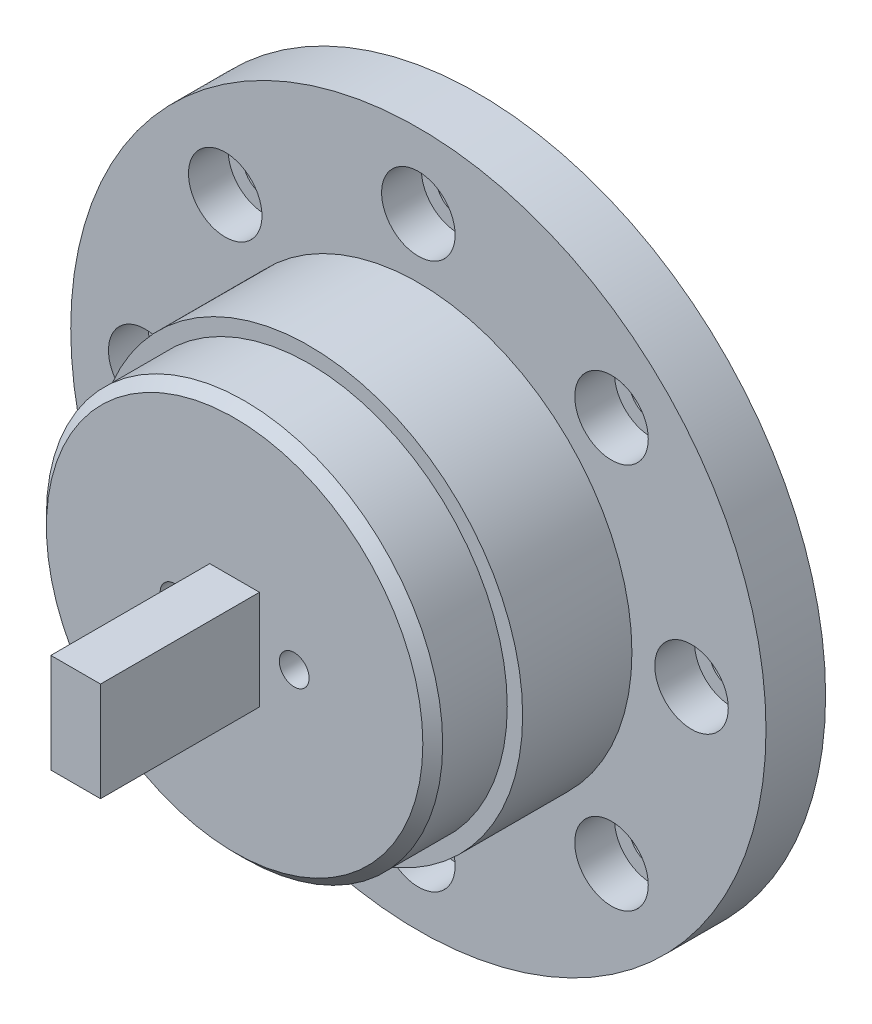
ISO-10303-21;
HEADER;
FILE_DESCRIPTION(('STEP AP214'),'2;1');
FILE_NAME('part.step','',(''),(''),'','','');
FILE_SCHEMA(('AUTOMOTIVE_DESIGN { 1 0 10303 214 1 1 1 1 }'));
ENDSEC;
DATA;
#1=APPLICATION_CONTEXT('core data for automotive mechanical design processes');
#2=APPLICATION_PROTOCOL_DEFINITION('international standard','automotive_design',2000,#1);
#3=PRODUCT_CONTEXT('',#1,'mechanical');
#4=PRODUCT('Part','Part','',(#3));
#5=PRODUCT_RELATED_PRODUCT_CATEGORY('part','',(#4));
#6=PRODUCT_DEFINITION_FORMATION('','',#4);
#7=PRODUCT_DEFINITION_CONTEXT('part definition',#1,'design');
#8=PRODUCT_DEFINITION('design','',#6,#7);
#9=PRODUCT_DEFINITION_SHAPE('','',#8);
#10=(LENGTH_UNIT() NAMED_UNIT(*) SI_UNIT(.MILLI.,.METRE.));
#11=(NAMED_UNIT(*) PLANE_ANGLE_UNIT() SI_UNIT($,.RADIAN.));
#12=(NAMED_UNIT(*) SI_UNIT($,.STERADIAN.) SOLID_ANGLE_UNIT());
#13=UNCERTAINTY_MEASURE_WITH_UNIT(LENGTH_MEASURE(1.E-05),#10,'distance_accuracy_value','');
#14=(GEOMETRIC_REPRESENTATION_CONTEXT(3) GLOBAL_UNCERTAINTY_ASSIGNED_CONTEXT((#13)) GLOBAL_UNIT_ASSIGNED_CONTEXT((#10,
#11,#12)) REPRESENTATION_CONTEXT('',''));
#15=CARTESIAN_POINT('',(0.,0.,0.));
#16=DIRECTION('',(0.,0.,1.));
#17=DIRECTION('',(1.,0.,0.));
#18=AXIS2_PLACEMENT_3D('',#15,#16,#17);
#19=CARTESIAN_POINT('',(0.,0.,2.));
#20=DIRECTION('',(0.,0.,1.));
#21=DIRECTION('',(1.,0.,0.));
#22=AXIS2_PLACEMENT_3D('',#19,#20,#21);
#23=PLANE('',#22);
#24=CARTESIAN_POINT('',(-27.5,0.,2.));
#25=DIRECTION('',(0.,0.,1.));
#26=DIRECTION('',(1.,0.,0.));
#27=AXIS2_PLACEMENT_3D('',#24,#25,#26);
#28=CIRCLE('',#27,2.2);
#29=CARTESIAN_POINT('',(-25.3,0.,2.));
#30=VERTEX_POINT('',#29);
#31=EDGE_CURVE('E221',#30,#30,#28,.T.);
#32=ORIENTED_EDGE('',*,*,#31,.F.);
#33=EDGE_LOOP('',(#32));
#34=FACE_BOUND('',#33,.T.);
#35=CARTESIAN_POINT('',(-27.5,0.,2.));
#36=DIRECTION('',(0.,0.,1.));
#37=DIRECTION('',(1.,0.,0.));
#38=AXIS2_PLACEMENT_3D('',#35,#36,#37);
#39=CIRCLE('',#38,3.7);
#40=CARTESIAN_POINT('',(-23.8,0.,2.));
#41=VERTEX_POINT('',#40);
#42=EDGE_CURVE('E146',#41,#41,#39,.T.);
#43=ORIENTED_EDGE('',*,*,#42,.T.);
#44=EDGE_LOOP('',(#43));
#45=FACE_BOUND('',#44,.T.);
#46=ADVANCED_FACE('F46',(#34,#45),#23,.T.);
#47=CARTESIAN_POINT('',(0.,-27.5,2.));
#48=DIRECTION('',(0.,0.,1.));
#49=DIRECTION('',(1.,0.,0.));
#50=AXIS2_PLACEMENT_3D('',#47,#48,#49);
#51=CIRCLE('',#50,2.2);
#52=CARTESIAN_POINT('',(2.2,-27.5,2.));
#53=VERTEX_POINT('',#52);
#54=EDGE_CURVE('E237',#53,#53,#51,.T.);
#55=ORIENTED_EDGE('',*,*,#54,.F.);
#56=EDGE_LOOP('',(#55));
#57=FACE_BOUND('',#56,.T.);
#58=CARTESIAN_POINT('',(0.,-27.5,2.));
#59=DIRECTION('',(0.,0.,1.));
#60=DIRECTION('',(1.,0.,0.));
#61=AXIS2_PLACEMENT_3D('',#58,#59,#60);
#62=CIRCLE('',#61,3.7);
#63=CARTESIAN_POINT('',(3.7,-27.5,2.));
#64=VERTEX_POINT('',#63);
#65=EDGE_CURVE('E187',#64,#64,#62,.T.);
#66=ORIENTED_EDGE('',*,*,#65,.T.);
#67=EDGE_LOOP('',(#66));
#68=FACE_BOUND('',#67,.T.);
#69=ADVANCED_FACE('F300',(#57,#68),#23,.T.);
#70=CARTESIAN_POINT('',(27.5,0.,2.));
#71=DIRECTION('',(0.,0.,1.));
#72=DIRECTION('',(1.,0.,0.));
#73=AXIS2_PLACEMENT_3D('',#70,#71,#72);
#74=CIRCLE('',#73,2.2);
#75=CARTESIAN_POINT('',(29.7,0.,2.));
#76=VERTEX_POINT('',#75);
#77=EDGE_CURVE('E253',#76,#76,#74,.T.);
#78=ORIENTED_EDGE('',*,*,#77,.F.);
#79=EDGE_LOOP('',(#78));
#80=FACE_BOUND('',#79,.T.);
#81=CARTESIAN_POINT('',(27.5,0.,2.));
#82=DIRECTION('',(0.,0.,1.));
#83=DIRECTION('',(1.,0.,0.));
#84=AXIS2_PLACEMENT_3D('',#81,#82,#83);
#85=CIRCLE('',#84,3.7);
#86=CARTESIAN_POINT('',(31.2,0.,2.));
#87=VERTEX_POINT('',#86);
#88=EDGE_CURVE('E191',#87,#87,#85,.T.);
#89=ORIENTED_EDGE('',*,*,#88,.T.);
#90=EDGE_LOOP('',(#89));
#91=FACE_BOUND('',#90,.T.);
#92=ADVANCED_FACE('F307',(#80,#91),#23,.T.);
#93=CARTESIAN_POINT('',(0.,27.5,2.));
#94=DIRECTION('',(0.,0.,1.));
#95=DIRECTION('',(1.,0.,0.));
#96=AXIS2_PLACEMENT_3D('',#93,#94,#95);
#97=CIRCLE('',#96,2.2);
#98=CARTESIAN_POINT('',(2.2,27.5,2.));
#99=VERTEX_POINT('',#98);
#100=EDGE_CURVE('E267',#99,#99,#97,.T.);
#101=ORIENTED_EDGE('',*,*,#100,.F.);
#102=EDGE_LOOP('',(#101));
#103=FACE_BOUND('',#102,.T.);
#104=CARTESIAN_POINT('',(0.,27.5,2.));
#105=DIRECTION('',(0.,0.,1.));
#106=DIRECTION('',(1.,0.,0.));
#107=AXIS2_PLACEMENT_3D('',#104,#105,#106);
#108=CIRCLE('',#107,3.7);
#109=CARTESIAN_POINT('',(3.7,27.5,2.));
#110=VERTEX_POINT('',#109);
#111=EDGE_CURVE('E194',#110,#110,#108,.T.);
#112=ORIENTED_EDGE('',*,*,#111,.T.);
#113=EDGE_LOOP('',(#112));
#114=FACE_BOUND('',#113,.T.);
#115=ADVANCED_FACE('F427',(#103,#114),#23,.T.);
#116=CARTESIAN_POINT('',(19.4454364826301,19.4454364826301,2.));
#117=DIRECTION('',(0.,0.,1.));
#118=DIRECTION('',(1.,0.,0.));
#119=AXIS2_PLACEMENT_3D('',#116,#117,#118);
#120=CIRCLE('',#119,2.20000000000001);
#121=CARTESIAN_POINT('',(21.6454364826301,19.4454364826301,2.));
#122=VERTEX_POINT('',#121);
#123=EDGE_CURVE('E259',#122,#122,#120,.T.);
#124=ORIENTED_EDGE('',*,*,#123,.F.);
#125=EDGE_LOOP('',(#124));
#126=FACE_BOUND('',#125,.T.);
#127=CARTESIAN_POINT('',(19.4454364826301,19.4454364826301,2.));
#128=DIRECTION('',(0.,0.,1.));
#129=DIRECTION('',(1.,0.,0.));
#130=AXIS2_PLACEMENT_3D('',#127,#128,#129);
#131=CIRCLE('',#130,3.70000000000001);
#132=CARTESIAN_POINT('',(23.1454364826301,19.4454364826301,2.));
#133=VERTEX_POINT('',#132);
#134=EDGE_CURVE('E198',#133,#133,#131,.T.);
#135=ORIENTED_EDGE('',*,*,#134,.T.);
#136=EDGE_LOOP('',(#135));
#137=FACE_BOUND('',#136,.T.);
#138=ADVANCED_FACE('F430',(#126,#137),#23,.T.);
#139=CARTESIAN_POINT('',(19.4454364826301,-19.4454364826301,2.));
#140=DIRECTION('',(0.,0.,1.));
#141=DIRECTION('',(1.,0.,0.));
#142=AXIS2_PLACEMENT_3D('',#139,#140,#141);
#143=CIRCLE('',#142,2.20000000000001);
#144=CARTESIAN_POINT('',(21.6454364826301,-19.4454364826301,2.));
#145=VERTEX_POINT('',#144);
#146=EDGE_CURVE('E245',#145,#145,#143,.T.);
#147=ORIENTED_EDGE('',*,*,#146,.F.);
#148=EDGE_LOOP('',(#147));
#149=FACE_BOUND('',#148,.T.);
#150=CARTESIAN_POINT('',(19.4454364826301,-19.4454364826301,2.));
#151=DIRECTION('',(0.,0.,1.));
#152=DIRECTION('',(1.,0.,0.));
#153=AXIS2_PLACEMENT_3D('',#150,#151,#152);
#154=CIRCLE('',#153,3.70000000000001);
#155=CARTESIAN_POINT('',(23.1454364826301,-19.4454364826301,2.));
#156=VERTEX_POINT('',#155);
#157=EDGE_CURVE('E202',#156,#156,#154,.T.);
#158=ORIENTED_EDGE('',*,*,#157,.T.);
#159=EDGE_LOOP('',(#158));
#160=FACE_BOUND('',#159,.T.);
#161=ADVANCED_FACE('F323',(#149,#160),#23,.T.);
#162=CARTESIAN_POINT('',(-19.4454364826301,-19.4454364826301,2.));
#163=DIRECTION('',(0.,0.,1.));
#164=DIRECTION('',(1.,0.,0.));
#165=AXIS2_PLACEMENT_3D('',#162,#163,#164);
#166=CIRCLE('',#165,2.2);
#167=CARTESIAN_POINT('',(-17.2454364826301,-19.4454364826301,2.));
#168=VERTEX_POINT('',#167);
#169=EDGE_CURVE('E229',#168,#168,#166,.T.);
#170=ORIENTED_EDGE('',*,*,#169,.F.);
#171=EDGE_LOOP('',(#170));
#172=FACE_BOUND('',#171,.T.);
#173=CARTESIAN_POINT('',(-19.4454364826301,-19.4454364826301,2.));
#174=DIRECTION('',(0.,0.,1.));
#175=DIRECTION('',(1.,0.,0.));
#176=AXIS2_PLACEMENT_3D('',#173,#174,#175);
#177=CIRCLE('',#176,3.7);
#178=CARTESIAN_POINT('',(-15.7454364826301,-19.4454364826301,2.));
#179=VERTEX_POINT('',#178);
#180=EDGE_CURVE('E206',#179,#179,#177,.T.);
#181=ORIENTED_EDGE('',*,*,#180,.T.);
#182=EDGE_LOOP('',(#181));
#183=FACE_BOUND('',#182,.T.);
#184=ADVANCED_FACE('F315',(#172,#183),#23,.T.);
#185=CARTESIAN_POINT('',(-19.4454364826301,19.4454364826301,2.));
#186=DIRECTION('',(0.,0.,1.));
#187=DIRECTION('',(1.,0.,0.));
#188=AXIS2_PLACEMENT_3D('',#185,#186,#187);
#189=CIRCLE('',#188,2.2);
#190=CARTESIAN_POINT('',(-17.2454364826301,19.4454364826301,2.));
#191=VERTEX_POINT('',#190);
#192=EDGE_CURVE('E213',#191,#191,#189,.T.);
#193=ORIENTED_EDGE('',*,*,#192,.F.);
#194=EDGE_LOOP('',(#193));
#195=FACE_BOUND('',#194,.T.);
#196=CARTESIAN_POINT('',(-19.4454364826301,19.4454364826301,2.));
#197=DIRECTION('',(0.,0.,1.));
#198=DIRECTION('',(1.,0.,0.));
#199=AXIS2_PLACEMENT_3D('',#196,#197,#198);
#200=CIRCLE('',#199,3.7);
#201=CARTESIAN_POINT('',(-15.7454364826301,19.4454364826301,2.));
#202=VERTEX_POINT('',#201);
#203=EDGE_CURVE('E152',#202,#202,#200,.T.);
#204=ORIENTED_EDGE('',*,*,#203,.T.);
#205=EDGE_LOOP('',(#204));
#206=FACE_BOUND('',#205,.T.);
#207=ADVANCED_FACE('F303',(#195,#206),#23,.T.);
#208=CARTESIAN_POINT('',(0.,0.,0.));
#209=DIRECTION('',(0.,0.,1.));
#210=DIRECTION('',(1.,0.,0.));
#211=AXIS2_PLACEMENT_3D('',#208,#209,#210);
#212=PLANE('',#211);
#213=CARTESIAN_POINT('',(-6.,0.,0.));
#214=DIRECTION('',(0.,0.,1.));
#215=DIRECTION('',(1.,0.,0.));
#216=AXIS2_PLACEMENT_3D('',#213,#214,#215);
#217=CIRCLE('',#216,1.5);
#218=CARTESIAN_POINT('',(-4.5,0.,0.));
#219=VERTEX_POINT('',#218);
#220=EDGE_CURVE('E824',#219,#219,#217,.T.);
#221=ORIENTED_EDGE('',*,*,#220,.T.);
#222=EDGE_LOOP('',(#221));
#223=FACE_BOUND('',#222,.T.);
#224=CARTESIAN_POINT('',(6.,0.,0.));
#225=DIRECTION('',(0.,0.,1.));
#226=DIRECTION('',(1.,0.,0.));
#227=AXIS2_PLACEMENT_3D('',#224,#225,#226);
#228=CIRCLE('',#227,1.5);
#229=CARTESIAN_POINT('',(7.5,0.,0.));
#230=VERTEX_POINT('',#229);
#231=EDGE_CURVE('E839',#230,#230,#228,.T.);
#232=ORIENTED_EDGE('',*,*,#231,.T.);
#233=EDGE_LOOP('',(#232));
#234=FACE_BOUND('',#233,.T.);
#235=CARTESIAN_POINT('',(0.,0.,0.));
#236=DIRECTION('',(0.,0.,1.));
#237=DIRECTION('',(1.,0.,0.));
#238=AXIS2_PLACEMENT_3D('',#235,#236,#237);
#239=CIRCLE('',#238,35.);
#240=CARTESIAN_POINT('',(35.,0.,0.));
#241=VERTEX_POINT('',#240);
#242=EDGE_CURVE('E271',#241,#241,#239,.T.);
#243=ORIENTED_EDGE('',*,*,#242,.F.);
#244=EDGE_LOOP('',(#243));
#245=FACE_BOUND('',#244,.T.);
#246=CARTESIAN_POINT('',(0.,27.5,0.));
#247=DIRECTION('',(0.,0.,1.));
#248=DIRECTION('',(1.,0.,0.));
#249=AXIS2_PLACEMENT_3D('',#246,#247,#248);
#250=CIRCLE('',#249,2.2);
#251=CARTESIAN_POINT('',(2.2,27.5,0.));
#252=VERTEX_POINT('',#251);
#253=EDGE_CURVE('E263',#252,#252,#250,.T.);
#254=ORIENTED_EDGE('',*,*,#253,.T.);
#255=EDGE_LOOP('',(#254));
#256=FACE_BOUND('',#255,.T.);
#257=CARTESIAN_POINT('',(19.4454364826301,19.4454364826301,0.));
#258=DIRECTION('',(0.,0.,1.));
#259=DIRECTION('',(1.,0.,0.));
#260=AXIS2_PLACEMENT_3D('',#257,#258,#259);
#261=CIRCLE('',#260,2.20000000000001);
#262=CARTESIAN_POINT('',(21.6454364826301,19.4454364826301,0.));
#263=VERTEX_POINT('',#262);
#264=EDGE_CURVE('E256',#263,#263,#261,.T.);
#265=ORIENTED_EDGE('',*,*,#264,.T.);
#266=EDGE_LOOP('',(#265));
#267=FACE_BOUND('',#266,.T.);
#268=CARTESIAN_POINT('',(27.5,0.,0.));
#269=DIRECTION('',(0.,0.,1.));
#270=DIRECTION('',(1.,0.,0.));
#271=AXIS2_PLACEMENT_3D('',#268,#269,#270);
#272=CIRCLE('',#271,2.2);
#273=CARTESIAN_POINT('',(29.7,0.,0.));
#274=VERTEX_POINT('',#273);
#275=EDGE_CURVE('E249',#274,#274,#272,.T.);
#276=ORIENTED_EDGE('',*,*,#275,.T.);
#277=EDGE_LOOP('',(#276));
#278=FACE_BOUND('',#277,.T.);
#279=CARTESIAN_POINT('',(19.4454364826301,-19.4454364826301,0.));
#280=DIRECTION('',(0.,0.,1.));
#281=DIRECTION('',(1.,0.,0.));
#282=AXIS2_PLACEMENT_3D('',#279,#280,#281);
#283=CIRCLE('',#282,2.20000000000001);
#284=CARTESIAN_POINT('',(21.6454364826301,-19.4454364826301,0.));
#285=VERTEX_POINT('',#284);
#286=EDGE_CURVE('E241',#285,#285,#283,.T.);
#287=ORIENTED_EDGE('',*,*,#286,.T.);
#288=EDGE_LOOP('',(#287));
#289=FACE_BOUND('',#288,.T.);
#290=CARTESIAN_POINT('',(0.,-27.5,0.));
#291=DIRECTION('',(0.,0.,1.));
#292=DIRECTION('',(1.,0.,0.));
#293=AXIS2_PLACEMENT_3D('',#290,#291,#292);
#294=CIRCLE('',#293,2.2);
#295=CARTESIAN_POINT('',(2.2,-27.5,0.));
#296=VERTEX_POINT('',#295);
#297=EDGE_CURVE('E233',#296,#296,#294,.T.);
#298=ORIENTED_EDGE('',*,*,#297,.T.);
#299=EDGE_LOOP('',(#298));
#300=FACE_BOUND('',#299,.T.);
#301=CARTESIAN_POINT('',(-19.4454364826301,-19.4454364826301,0.));
#302=DIRECTION('',(0.,0.,1.));
#303=DIRECTION('',(1.,0.,0.));
#304=AXIS2_PLACEMENT_3D('',#301,#302,#303);
#305=CIRCLE('',#304,2.2);
#306=CARTESIAN_POINT('',(-17.2454364826301,-19.4454364826301,0.));
#307=VERTEX_POINT('',#306);
#308=EDGE_CURVE('E225',#307,#307,#305,.T.);
#309=ORIENTED_EDGE('',*,*,#308,.T.);
#310=EDGE_LOOP('',(#309));
#311=FACE_BOUND('',#310,.T.);
#312=CARTESIAN_POINT('',(-27.5,0.,0.));
#313=DIRECTION('',(0.,0.,1.));
#314=DIRECTION('',(1.,0.,0.));
#315=AXIS2_PLACEMENT_3D('',#312,#313,#314);
#316=CIRCLE('',#315,2.2);
#317=CARTESIAN_POINT('',(-25.3,0.,0.));
#318=VERTEX_POINT('',#317);
#319=EDGE_CURVE('E217',#318,#318,#316,.T.);
#320=ORIENTED_EDGE('',*,*,#319,.T.);
#321=EDGE_LOOP('',(#320));
#322=FACE_BOUND('',#321,.T.);
#323=CARTESIAN_POINT('',(-19.4454364826301,19.4454364826301,0.));
#324=DIRECTION('',(0.,0.,1.));
#325=DIRECTION('',(1.,0.,0.));
#326=AXIS2_PLACEMENT_3D('',#323,#324,#325);
#327=CIRCLE('',#326,2.2);
#328=CARTESIAN_POINT('',(-17.2454364826301,19.4454364826301,0.));
#329=VERTEX_POINT('',#328);
#330=EDGE_CURVE('E183',#329,#329,#327,.T.);
#331=ORIENTED_EDGE('',*,*,#330,.T.);
#332=EDGE_LOOP('',(#331));
#333=FACE_BOUND('',#332,.T.);
#334=ADVANCED_FACE('F314',(#223,#234,#245,#256,#267,#278,#289,#300,#311,#322,#333),#212,.F.);
#335=CARTESIAN_POINT('',(0.,0.,2.));
#336=DIRECTION('',(0.,0.,-1.));
#337=DIRECTION('',(-1.,0.,0.));
#338=AXIS2_PLACEMENT_3D('',#335,#336,#337);
#339=CYLINDRICAL_SURFACE('',#338,35.);
#340=ORIENTED_EDGE('',*,*,#242,.T.);
#341=EDGE_LOOP('',(#340));
#342=FACE_BOUND('',#341,.T.);
#343=CARTESIAN_POINT('',(0.,0.,6.));
#344=DIRECTION('',(0.,0.,1.));
#345=DIRECTION('',(1.,0.,0.));
#346=AXIS2_PLACEMENT_3D('',#343,#344,#345);
#347=CIRCLE('',#346,35.);
#348=CARTESIAN_POINT('',(35.,0.,6.));
#349=VERTEX_POINT('',#348);
#350=EDGE_CURVE('E179',#349,#349,#347,.T.);
#351=ORIENTED_EDGE('',*,*,#350,.F.);
#352=EDGE_LOOP('',(#351));
#353=FACE_BOUND('',#352,.T.);
#354=ADVANCED_FACE('F321',(#342,#353),#339,.T.);
#355=CARTESIAN_POINT('',(0.,27.5,2.));
#356=DIRECTION('',(0.,0.,-1.));
#357=DIRECTION('',(-1.,0.,0.));
#358=AXIS2_PLACEMENT_3D('',#355,#356,#357);
#359=CYLINDRICAL_SURFACE('',#358,2.2);
#360=ORIENTED_EDGE('',*,*,#100,.T.);
#361=EDGE_LOOP('',(#360));
#362=FACE_BOUND('',#361,.T.);
#363=ORIENTED_EDGE('',*,*,#253,.F.);
#364=EDGE_LOOP('',(#363));
#365=FACE_BOUND('',#364,.T.);
#366=ADVANCED_FACE('F393',(#362,#365),#359,.F.);
#367=CARTESIAN_POINT('',(19.4454364826301,19.4454364826301,2.));
#368=DIRECTION('',(0.,0.,-1.));
#369=DIRECTION('',(-1.,0.,0.));
#370=AXIS2_PLACEMENT_3D('',#367,#368,#369);
#371=CYLINDRICAL_SURFACE('',#370,2.20000000000001);
#372=ORIENTED_EDGE('',*,*,#123,.T.);
#373=EDGE_LOOP('',(#372));
#374=FACE_BOUND('',#373,.T.);
#375=ORIENTED_EDGE('',*,*,#264,.F.);
#376=EDGE_LOOP('',(#375));
#377=FACE_BOUND('',#376,.T.);
#378=ADVANCED_FACE('F390',(#374,#377),#371,.F.);
#379=CARTESIAN_POINT('',(27.5,0.,2.));
#380=DIRECTION('',(0.,0.,-1.));
#381=DIRECTION('',(-1.,0.,0.));
#382=AXIS2_PLACEMENT_3D('',#379,#380,#381);
#383=CYLINDRICAL_SURFACE('',#382,2.2);
#384=ORIENTED_EDGE('',*,*,#77,.T.);
#385=EDGE_LOOP('',(#384));
#386=FACE_BOUND('',#385,.T.);
#387=ORIENTED_EDGE('',*,*,#275,.F.);
#388=EDGE_LOOP('',(#387));
#389=FACE_BOUND('',#388,.T.);
#390=ADVANCED_FACE('F386',(#386,#389),#383,.F.);
#391=CARTESIAN_POINT('',(19.4454364826301,-19.4454364826301,2.));
#392=DIRECTION('',(0.,0.,-1.));
#393=DIRECTION('',(-1.,0.,0.));
#394=AXIS2_PLACEMENT_3D('',#391,#392,#393);
#395=CYLINDRICAL_SURFACE('',#394,2.20000000000001);
#396=ORIENTED_EDGE('',*,*,#146,.T.);
#397=EDGE_LOOP('',(#396));
#398=FACE_BOUND('',#397,.T.);
#399=ORIENTED_EDGE('',*,*,#286,.F.);
#400=EDGE_LOOP('',(#399));
#401=FACE_BOUND('',#400,.T.);
#402=ADVANCED_FACE('F382',(#398,#401),#395,.F.);
#403=CARTESIAN_POINT('',(0.,-27.5,2.));
#404=DIRECTION('',(0.,0.,-1.));
#405=DIRECTION('',(-1.,0.,0.));
#406=AXIS2_PLACEMENT_3D('',#403,#404,#405);
#407=CYLINDRICAL_SURFACE('',#406,2.2);
#408=ORIENTED_EDGE('',*,*,#54,.T.);
#409=EDGE_LOOP('',(#408));
#410=FACE_BOUND('',#409,.T.);
#411=ORIENTED_EDGE('',*,*,#297,.F.);
#412=EDGE_LOOP('',(#411));
#413=FACE_BOUND('',#412,.T.);
#414=ADVANCED_FACE('F378',(#410,#413),#407,.F.);
#415=CARTESIAN_POINT('',(-19.4454364826301,-19.4454364826301,2.));
#416=DIRECTION('',(0.,0.,-1.));
#417=DIRECTION('',(-1.,0.,0.));
#418=AXIS2_PLACEMENT_3D('',#415,#416,#417);
#419=CYLINDRICAL_SURFACE('',#418,2.2);
#420=ORIENTED_EDGE('',*,*,#169,.T.);
#421=EDGE_LOOP('',(#420));
#422=FACE_BOUND('',#421,.T.);
#423=ORIENTED_EDGE('',*,*,#308,.F.);
#424=EDGE_LOOP('',(#423));
#425=FACE_BOUND('',#424,.T.);
#426=ADVANCED_FACE('F374',(#422,#425),#419,.F.);
#427=CARTESIAN_POINT('',(-27.5,0.,2.));
#428=DIRECTION('',(0.,0.,-1.));
#429=DIRECTION('',(-1.,0.,0.));
#430=AXIS2_PLACEMENT_3D('',#427,#428,#429);
#431=CYLINDRICAL_SURFACE('',#430,2.2);
#432=ORIENTED_EDGE('',*,*,#31,.T.);
#433=EDGE_LOOP('',(#432));
#434=FACE_BOUND('',#433,.T.);
#435=ORIENTED_EDGE('',*,*,#319,.F.);
#436=EDGE_LOOP('',(#435));
#437=FACE_BOUND('',#436,.T.);
#438=ADVANCED_FACE('F342',(#434,#437),#431,.F.);
#439=CARTESIAN_POINT('',(-19.4454364826301,19.4454364826301,2.));
#440=DIRECTION('',(0.,0.,-1.));
#441=DIRECTION('',(-1.,0.,0.));
#442=AXIS2_PLACEMENT_3D('',#439,#440,#441);
#443=CYLINDRICAL_SURFACE('',#442,2.2);
#444=ORIENTED_EDGE('',*,*,#192,.T.);
#445=EDGE_LOOP('',(#444));
#446=FACE_BOUND('',#445,.T.);
#447=ORIENTED_EDGE('',*,*,#330,.F.);
#448=EDGE_LOOP('',(#447));
#449=FACE_BOUND('',#448,.T.);
#450=ADVANCED_FACE('F332',(#446,#449),#443,.F.);
#451=CARTESIAN_POINT('',(-19.4454364826301,19.4454364826301,6.));
#452=DIRECTION('',(0.,0.,-1.));
#453=DIRECTION('',(-1.,0.,0.));
#454=AXIS2_PLACEMENT_3D('',#451,#452,#453);
#455=CYLINDRICAL_SURFACE('',#454,3.7);
#456=CARTESIAN_POINT('',(-19.4454364826301,19.4454364826301,6.));
#457=DIRECTION('',(0.,0.,1.));
#458=DIRECTION('',(1.,0.,0.));
#459=AXIS2_PLACEMENT_3D('',#456,#457,#458);
#460=CIRCLE('',#459,3.7);
#461=CARTESIAN_POINT('',(-15.7454364826301,19.4454364826301,6.));
#462=VERTEX_POINT('',#461);
#463=EDGE_CURVE('E175',#462,#462,#460,.T.);
#464=ORIENTED_EDGE('',*,*,#463,.T.);
#465=EDGE_LOOP('',(#464));
#466=FACE_BOUND('',#465,.T.);
#467=ORIENTED_EDGE('',*,*,#203,.F.);
#468=EDGE_LOOP('',(#467));
#469=FACE_BOUND('',#468,.T.);
#470=ADVANCED_FACE('F329',(#466,#469),#455,.F.);
#471=CARTESIAN_POINT('',(-19.4454364826301,-19.4454364826301,6.));
#472=DIRECTION('',(0.,0.,-1.));
#473=DIRECTION('',(-1.,0.,0.));
#474=AXIS2_PLACEMENT_3D('',#471,#472,#473);
#475=CYLINDRICAL_SURFACE('',#474,3.7);
#476=CARTESIAN_POINT('',(-19.4454364826301,-19.4454364826301,6.));
#477=DIRECTION('',(0.,0.,1.));
#478=DIRECTION('',(1.,0.,0.));
#479=AXIS2_PLACEMENT_3D('',#476,#477,#478);
#480=CIRCLE('',#479,3.7);
#481=CARTESIAN_POINT('',(-15.7454364826301,-19.4454364826301,6.));
#482=VERTEX_POINT('',#481);
#483=EDGE_CURVE('E171',#482,#482,#480,.T.);
#484=ORIENTED_EDGE('',*,*,#483,.T.);
#485=EDGE_LOOP('',(#484));
#486=FACE_BOUND('',#485,.T.);
#487=ORIENTED_EDGE('',*,*,#180,.F.);
#488=EDGE_LOOP('',(#487));
#489=FACE_BOUND('',#488,.T.);
#490=ADVANCED_FACE('F331',(#486,#489),#475,.F.);
#491=CARTESIAN_POINT('',(19.4454364826301,-19.4454364826301,6.));
#492=DIRECTION('',(0.,0.,-1.));
#493=DIRECTION('',(-1.,0.,0.));
#494=AXIS2_PLACEMENT_3D('',#491,#492,#493);
#495=CYLINDRICAL_SURFACE('',#494,3.70000000000001);
#496=CARTESIAN_POINT('',(19.4454364826301,-19.4454364826301,6.));
#497=DIRECTION('',(0.,0.,1.));
#498=DIRECTION('',(1.,0.,0.));
#499=AXIS2_PLACEMENT_3D('',#496,#497,#498);
#500=CIRCLE('',#499,3.70000000000001);
#501=CARTESIAN_POINT('',(23.1454364826301,-19.4454364826301,6.));
#502=VERTEX_POINT('',#501);
#503=EDGE_CURVE('E167',#502,#502,#500,.T.);
#504=ORIENTED_EDGE('',*,*,#503,.T.);
#505=EDGE_LOOP('',(#504));
#506=FACE_BOUND('',#505,.T.);
#507=ORIENTED_EDGE('',*,*,#157,.F.);
#508=EDGE_LOOP('',(#507));
#509=FACE_BOUND('',#508,.T.);
#510=ADVANCED_FACE('F339',(#506,#509),#495,.F.);
#511=CARTESIAN_POINT('',(19.4454364826301,19.4454364826301,6.));
#512=DIRECTION('',(0.,0.,-1.));
#513=DIRECTION('',(-1.,0.,0.));
#514=AXIS2_PLACEMENT_3D('',#511,#512,#513);
#515=CYLINDRICAL_SURFACE('',#514,3.70000000000001);
#516=CARTESIAN_POINT('',(19.4454364826301,19.4454364826301,6.));
#517=DIRECTION('',(0.,0.,1.));
#518=DIRECTION('',(1.,0.,0.));
#519=AXIS2_PLACEMENT_3D('',#516,#517,#518);
#520=CIRCLE('',#519,3.70000000000001);
#521=CARTESIAN_POINT('',(23.1454364826301,19.4454364826301,6.));
#522=VERTEX_POINT('',#521);
#523=EDGE_CURVE('E163',#522,#522,#520,.T.);
#524=ORIENTED_EDGE('',*,*,#523,.T.);
#525=EDGE_LOOP('',(#524));
#526=FACE_BOUND('',#525,.T.);
#527=ORIENTED_EDGE('',*,*,#134,.F.);
#528=EDGE_LOOP('',(#527));
#529=FACE_BOUND('',#528,.T.);
#530=ADVANCED_FACE('F351',(#526,#529),#515,.F.);
#531=CARTESIAN_POINT('',(0.,27.5,6.));
#532=DIRECTION('',(0.,0.,-1.));
#533=DIRECTION('',(-1.,0.,0.));
#534=AXIS2_PLACEMENT_3D('',#531,#532,#533);
#535=CYLINDRICAL_SURFACE('',#534,3.7);
#536=CARTESIAN_POINT('',(0.,27.5,6.));
#537=DIRECTION('',(0.,0.,1.));
#538=DIRECTION('',(1.,0.,0.));
#539=AXIS2_PLACEMENT_3D('',#536,#537,#538);
#540=CIRCLE('',#539,3.7);
#541=CARTESIAN_POINT('',(3.7,27.5,6.));
#542=VERTEX_POINT('',#541);
#543=EDGE_CURVE('E159',#542,#542,#540,.T.);
#544=ORIENTED_EDGE('',*,*,#543,.T.);
#545=EDGE_LOOP('',(#544));
#546=FACE_BOUND('',#545,.T.);
#547=ORIENTED_EDGE('',*,*,#111,.F.);
#548=EDGE_LOOP('',(#547));
#549=FACE_BOUND('',#548,.T.);
#550=ADVANCED_FACE('F355',(#546,#549),#535,.F.);
#551=CARTESIAN_POINT('',(27.5,0.,6.));
#552=DIRECTION('',(0.,0.,-1.));
#553=DIRECTION('',(-1.,0.,0.));
#554=AXIS2_PLACEMENT_3D('',#551,#552,#553);
#555=CYLINDRICAL_SURFACE('',#554,3.7);
#556=CARTESIAN_POINT('',(27.5,0.,6.));
#557=DIRECTION('',(0.,0.,1.));
#558=DIRECTION('',(1.,0.,0.));
#559=AXIS2_PLACEMENT_3D('',#556,#557,#558);
#560=CIRCLE('',#559,3.7);
#561=CARTESIAN_POINT('',(31.2,0.,6.));
#562=VERTEX_POINT('',#561);
#563=EDGE_CURVE('E156',#562,#562,#560,.T.);
#564=ORIENTED_EDGE('',*,*,#563,.T.);
#565=EDGE_LOOP('',(#564));
#566=FACE_BOUND('',#565,.T.);
#567=ORIENTED_EDGE('',*,*,#88,.F.);
#568=EDGE_LOOP('',(#567));
#569=FACE_BOUND('',#568,.T.);
#570=ADVANCED_FACE('F359',(#566,#569),#555,.F.);
#571=CARTESIAN_POINT('',(0.,-27.5,6.));
#572=DIRECTION('',(0.,0.,-1.));
#573=DIRECTION('',(-1.,0.,0.));
#574=AXIS2_PLACEMENT_3D('',#571,#572,#573);
#575=CYLINDRICAL_SURFACE('',#574,3.7);
#576=CARTESIAN_POINT('',(0.,-27.5,6.));
#577=DIRECTION('',(0.,0.,1.));
#578=DIRECTION('',(1.,0.,0.));
#579=AXIS2_PLACEMENT_3D('',#576,#577,#578);
#580=CIRCLE('',#579,3.7);
#581=CARTESIAN_POINT('',(3.7,-27.5,6.));
#582=VERTEX_POINT('',#581);
#583=EDGE_CURVE('E151',#582,#582,#580,.T.);
#584=ORIENTED_EDGE('',*,*,#583,.T.);
#585=EDGE_LOOP('',(#584));
#586=FACE_BOUND('',#585,.T.);
#587=ORIENTED_EDGE('',*,*,#65,.F.);
#588=EDGE_LOOP('',(#587));
#589=FACE_BOUND('',#588,.T.);
#590=ADVANCED_FACE('F363',(#586,#589),#575,.F.);
#591=CARTESIAN_POINT('',(-27.5,0.,6.));
#592=DIRECTION('',(0.,0.,-1.));
#593=DIRECTION('',(-1.,0.,0.));
#594=AXIS2_PLACEMENT_3D('',#591,#592,#593);
#595=CYLINDRICAL_SURFACE('',#594,3.7);
#596=CARTESIAN_POINT('',(-27.5,0.,6.));
#597=DIRECTION('',(0.,0.,1.));
#598=DIRECTION('',(1.,0.,0.));
#599=AXIS2_PLACEMENT_3D('',#596,#597,#598);
#600=CIRCLE('',#599,3.7);
#601=CARTESIAN_POINT('',(-23.8,0.,6.));
#602=VERTEX_POINT('',#601);
#603=EDGE_CURVE('E147',#602,#602,#600,.T.);
#604=ORIENTED_EDGE('',*,*,#603,.T.);
#605=EDGE_LOOP('',(#604));
#606=FACE_BOUND('',#605,.T.);
#607=ORIENTED_EDGE('',*,*,#42,.F.);
#608=EDGE_LOOP('',(#607));
#609=FACE_BOUND('',#608,.T.);
#610=ADVANCED_FACE('F367',(#606,#609),#595,.F.);
#611=CARTESIAN_POINT('',(0.,0.,6.));
#612=DIRECTION('',(0.,0.,1.));
#613=DIRECTION('',(1.,0.,0.));
#614=AXIS2_PLACEMENT_3D('',#611,#612,#613);
#615=PLANE('',#614);
#616=CARTESIAN_POINT('',(0.,0.,6.));
#617=DIRECTION('',(0.,0.,1.));
#618=DIRECTION('',(1.,0.,0.));
#619=AXIS2_PLACEMENT_3D('',#616,#617,#618);
#620=CIRCLE('',#619,21.5);
#621=CARTESIAN_POINT('',(21.5,0.,6.));
#622=VERTEX_POINT('',#621);
#623=EDGE_CURVE('E793',#622,#622,#620,.T.);
#624=ORIENTED_EDGE('',*,*,#623,.F.);
#625=EDGE_LOOP('',(#624));
#626=FACE_BOUND('',#625,.T.);
#627=ORIENTED_EDGE('',*,*,#603,.F.);
#628=EDGE_LOOP('',(#627));
#629=FACE_BOUND('',#628,.T.);
#630=ORIENTED_EDGE('',*,*,#583,.F.);
#631=EDGE_LOOP('',(#630));
#632=FACE_BOUND('',#631,.T.);
#633=ORIENTED_EDGE('',*,*,#563,.F.);
#634=EDGE_LOOP('',(#633));
#635=FACE_BOUND('',#634,.T.);
#636=ORIENTED_EDGE('',*,*,#543,.F.);
#637=EDGE_LOOP('',(#636));
#638=FACE_BOUND('',#637,.T.);
#639=ORIENTED_EDGE('',*,*,#523,.F.);
#640=EDGE_LOOP('',(#639));
#641=FACE_BOUND('',#640,.T.);
#642=ORIENTED_EDGE('',*,*,#503,.F.);
#643=EDGE_LOOP('',(#642));
#644=FACE_BOUND('',#643,.T.);
#645=ORIENTED_EDGE('',*,*,#483,.F.);
#646=EDGE_LOOP('',(#645));
#647=FACE_BOUND('',#646,.T.);
#648=ORIENTED_EDGE('',*,*,#463,.F.);
#649=EDGE_LOOP('',(#648));
#650=FACE_BOUND('',#649,.T.);
#651=ORIENTED_EDGE('',*,*,#350,.T.);
#652=EDGE_LOOP('',(#651));
#653=FACE_BOUND('',#652,.T.);
#654=ADVANCED_FACE('F346',(#626,#629,#632,#635,#638,#641,#644,#647,#650,#653),#615,.T.);
#655=CARTESIAN_POINT('',(0.,0.,17.));
#656=DIRECTION('',(0.,0.,-1.));
#657=DIRECTION('',(-1.,0.,0.));
#658=AXIS2_PLACEMENT_3D('',#655,#656,#657);
#659=CYLINDRICAL_SURFACE('',#658,21.5);
#660=CARTESIAN_POINT('',(0.,0.,17.));
#661=DIRECTION('',(0.,0.,1.));
#662=DIRECTION('',(1.,0.,0.));
#663=AXIS2_PLACEMENT_3D('',#660,#661,#662);
#664=CIRCLE('',#663,21.5);
#665=CARTESIAN_POINT('',(21.5,0.,17.));
#666=VERTEX_POINT('',#665);
#667=EDGE_CURVE('E280',#666,#666,#664,.T.);
#668=ORIENTED_EDGE('',*,*,#667,.F.);
#669=EDGE_LOOP('',(#668));
#670=FACE_BOUND('',#669,.T.);
#671=ORIENTED_EDGE('',*,*,#623,.T.);
#672=EDGE_LOOP('',(#671));
#673=FACE_BOUND('',#672,.T.);
#674=ADVANCED_FACE('F587',(#670,#673),#659,.T.);
#675=CARTESIAN_POINT('',(0.,0.,17.));
#676=DIRECTION('',(0.,0.,1.));
#677=DIRECTION('',(1.,0.,0.));
#678=AXIS2_PLACEMENT_3D('',#675,#676,#677);
#679=PLANE('',#678);
#680=CARTESIAN_POINT('',(0.,0.,17.));
#681=DIRECTION('',(0.,0.,1.));
#682=DIRECTION('',(1.,0.,0.));
#683=AXIS2_PLACEMENT_3D('',#680,#681,#682);
#684=CIRCLE('',#683,19.95);
#685=CARTESIAN_POINT('',(19.95,0.,17.));
#686=VERTEX_POINT('',#685);
#687=EDGE_CURVE('E132',#686,#686,#684,.T.);
#688=ORIENTED_EDGE('',*,*,#687,.F.);
#689=EDGE_LOOP('',(#688));
#690=FACE_BOUND('',#689,.T.);
#691=ORIENTED_EDGE('',*,*,#667,.T.);
#692=EDGE_LOOP('',(#691));
#693=FACE_BOUND('',#692,.T.);
#694=ADVANCED_FACE('F534',(#690,#693),#679,.T.);
#695=CARTESIAN_POINT('',(0.,0.,40.5));
#696=DIRECTION('',(0.,0.,1.));
#697=DIRECTION('',(1.,0.,0.));
#698=AXIS2_PLACEMENT_3D('',#695,#696,#697);
#699=PLANE('',#698);
#700=DIRECTION('',(0.,-1.,0.));
#701=VECTOR('',#700,1.);
#702=CARTESIAN_POINT('',(-2.5,-5.,40.5));
#703=LINE('',#702,#701);
#704=CARTESIAN_POINT('',(-2.5,5.,40.5));
#705=VERTEX_POINT('',#704);
#706=CARTESIAN_POINT('',(-2.5,-5.,40.5));
#707=VERTEX_POINT('',#706);
#708=EDGE_CURVE('E105',#705,#707,#703,.T.);
#709=ORIENTED_EDGE('',*,*,#708,.T.);
#710=DIRECTION('',(1.,0.,0.));
#711=VECTOR('',#710,1.);
#712=CARTESIAN_POINT('',(2.5,-5.,40.5));
#713=LINE('',#712,#711);
#714=CARTESIAN_POINT('',(2.5,-5.,40.5));
#715=VERTEX_POINT('',#714);
#716=EDGE_CURVE('E99',#707,#715,#713,.T.);
#717=ORIENTED_EDGE('',*,*,#716,.T.);
#718=DIRECTION('',(0.,1.,0.));
#719=VECTOR('',#718,1.);
#720=CARTESIAN_POINT('',(2.5,-5.,40.5));
#721=LINE('',#720,#719);
#722=CARTESIAN_POINT('',(2.5,5.,40.5));
#723=VERTEX_POINT('',#722);
#724=EDGE_CURVE('E103',#715,#723,#721,.T.);
#725=ORIENTED_EDGE('',*,*,#724,.T.);
#726=DIRECTION('',(-1.,0.,0.));
#727=VECTOR('',#726,1.);
#728=CARTESIAN_POINT('',(2.5,5.,40.5));
#729=LINE('',#728,#727);
#730=EDGE_CURVE('E77',#723,#705,#729,.T.);
#731=ORIENTED_EDGE('',*,*,#730,.T.);
#732=EDGE_LOOP('',(#709,#717,#725,#731));
#733=FACE_BOUND('',#732,.T.);
#734=ADVANCED_FACE('F101',(#733),#699,.T.);
#735=CARTESIAN_POINT('',(2.5,-5.,40.5));
#736=DIRECTION('',(-1.,0.,0.));
#737=DIRECTION('',(0.,0.,1.));
#738=AXIS2_PLACEMENT_3D('',#735,#736,#737);
#739=PLANE('',#738);
#740=DIRECTION('',(0.,1.,0.));
#741=VECTOR('',#740,1.);
#742=CARTESIAN_POINT('',(2.5,-5.,24.5));
#743=LINE('',#742,#741);
#744=CARTESIAN_POINT('',(2.5,-5.,24.5));
#745=VERTEX_POINT('',#744);
#746=CARTESIAN_POINT('',(2.5,5.,24.5));
#747=VERTEX_POINT('',#746);
#748=EDGE_CURVE('E135',#745,#747,#743,.T.);
#749=ORIENTED_EDGE('',*,*,#748,.T.);
#750=DIRECTION('',(0.,0.,-1.));
#751=VECTOR('',#750,1.);
#752=CARTESIAN_POINT('',(2.5,5.,40.5));
#753=LINE('',#752,#751);
#754=EDGE_CURVE('E66',#723,#747,#753,.T.);
#755=ORIENTED_EDGE('',*,*,#754,.F.);
#756=ORIENTED_EDGE('',*,*,#724,.F.);
#757=DIRECTION('',(0.,0.,-1.));
#758=VECTOR('',#757,1.);
#759=CARTESIAN_POINT('',(2.5,-5.,40.5));
#760=LINE('',#759,#758);
#761=EDGE_CURVE('E110',#715,#745,#760,.T.);
#762=ORIENTED_EDGE('',*,*,#761,.T.);
#763=EDGE_LOOP('',(#749,#755,#756,#762));
#764=FACE_BOUND('',#763,.T.);
#765=ADVANCED_FACE('F119',(#764),#739,.F.);
#766=CARTESIAN_POINT('',(2.5,5.,40.5));
#767=DIRECTION('',(0.,-1.,0.));
#768=DIRECTION('',(0.,0.,-1.));
#769=AXIS2_PLACEMENT_3D('',#766,#767,#768);
#770=PLANE('',#769);
#771=DIRECTION('',(-1.,0.,0.));
#772=VECTOR('',#771,1.);
#773=CARTESIAN_POINT('',(2.5,5.,24.5));
#774=LINE('',#773,#772);
#775=CARTESIAN_POINT('',(-2.5,5.,24.5));
#776=VERTEX_POINT('',#775);
#777=EDGE_CURVE('E92',#747,#776,#774,.T.);
#778=ORIENTED_EDGE('',*,*,#777,.T.);
#779=DIRECTION('',(0.,0.,-1.));
#780=VECTOR('',#779,1.);
#781=CARTESIAN_POINT('',(-2.5,5.,40.5));
#782=LINE('',#781,#780);
#783=EDGE_CURVE('E124',#705,#776,#782,.T.);
#784=ORIENTED_EDGE('',*,*,#783,.F.);
#785=ORIENTED_EDGE('',*,*,#730,.F.);
#786=ORIENTED_EDGE('',*,*,#754,.T.);
#787=EDGE_LOOP('',(#778,#784,#785,#786));
#788=FACE_BOUND('',#787,.T.);
#789=ADVANCED_FACE('F609',(#788),#770,.F.);
#790=CARTESIAN_POINT('',(-2.5,-5.,40.5));
#791=DIRECTION('',(1.,0.,0.));
#792=DIRECTION('',(0.,1.,0.));
#793=AXIS2_PLACEMENT_3D('',#790,#791,#792);
#794=PLANE('',#793);
#795=DIRECTION('',(0.,-1.,0.));
#796=VECTOR('',#795,1.);
#797=CARTESIAN_POINT('',(-2.5,-5.,24.5));
#798=LINE('',#797,#796);
#799=CARTESIAN_POINT('',(-2.5,-5.,24.5));
#800=VERTEX_POINT('',#799);
#801=EDGE_CURVE('E128',#776,#800,#798,.T.);
#802=ORIENTED_EDGE('',*,*,#801,.T.);
#803=DIRECTION('',(0.,0.,-1.));
#804=VECTOR('',#803,1.);
#805=CARTESIAN_POINT('',(-2.5,-5.,40.5));
#806=LINE('',#805,#804);
#807=EDGE_CURVE('E117',#707,#800,#806,.T.);
#808=ORIENTED_EDGE('',*,*,#807,.F.);
#809=ORIENTED_EDGE('',*,*,#708,.F.);
#810=ORIENTED_EDGE('',*,*,#783,.T.);
#811=EDGE_LOOP('',(#802,#808,#809,#810));
#812=FACE_BOUND('',#811,.T.);
#813=ADVANCED_FACE('F613',(#812),#794,.F.);
#814=CARTESIAN_POINT('',(2.5,-5.,40.5));
#815=DIRECTION('',(0.,1.,0.));
#816=DIRECTION('',(-1.,0.,0.));
#817=AXIS2_PLACEMENT_3D('',#814,#815,#816);
#818=PLANE('',#817);
#819=DIRECTION('',(1.,0.,0.));
#820=VECTOR('',#819,1.);
#821=CARTESIAN_POINT('',(2.5,-5.,24.5));
#822=LINE('',#821,#820);
#823=EDGE_CURVE('E113',#800,#745,#822,.T.);
#824=ORIENTED_EDGE('',*,*,#823,.T.);
#825=ORIENTED_EDGE('',*,*,#761,.F.);
#826=ORIENTED_EDGE('',*,*,#716,.F.);
#827=ORIENTED_EDGE('',*,*,#807,.T.);
#828=EDGE_LOOP('',(#824,#825,#826,#827));
#829=FACE_BOUND('',#828,.T.);
#830=ADVANCED_FACE('F111',(#829),#818,.F.);
#831=CARTESIAN_POINT('',(0.,0.,24.5));
#832=DIRECTION('',(0.,0.,1.));
#833=DIRECTION('',(1.,0.,0.));
#834=AXIS2_PLACEMENT_3D('',#831,#832,#833);
#835=PLANE('',#834);
#836=CARTESIAN_POINT('',(0.,0.,24.5));
#837=DIRECTION('',(0.,0.,1.));
#838=DIRECTION('',(1.,0.,0.));
#839=AXIS2_PLACEMENT_3D('',#836,#837,#838);
#840=CIRCLE('',#839,18.95);
#841=CARTESIAN_POINT('',(18.95,0.,24.5));
#842=VERTEX_POINT('',#841);
#843=EDGE_CURVE('E56',#842,#842,#840,.T.);
#844=ORIENTED_EDGE('',*,*,#843,.T.);
#845=EDGE_LOOP('',(#844));
#846=FACE_BOUND('',#845,.T.);
#847=CARTESIAN_POINT('',(-6.,0.,24.5));
#848=DIRECTION('',(0.,0.,1.));
#849=DIRECTION('',(1.,0.,0.));
#850=AXIS2_PLACEMENT_3D('',#847,#848,#849);
#851=CIRCLE('',#850,1.5);
#852=CARTESIAN_POINT('',(-4.5,0.,24.5));
#853=VERTEX_POINT('',#852);
#854=EDGE_CURVE('E830',#853,#853,#851,.T.);
#855=ORIENTED_EDGE('',*,*,#854,.F.);
#856=EDGE_LOOP('',(#855));
#857=FACE_BOUND('',#856,.T.);
#858=CARTESIAN_POINT('',(6.,0.,24.5));
#859=DIRECTION('',(0.,0.,1.));
#860=DIRECTION('',(1.,0.,0.));
#861=AXIS2_PLACEMENT_3D('',#858,#859,#860);
#862=CIRCLE('',#861,1.5);
#863=CARTESIAN_POINT('',(7.5,0.,24.5));
#864=VERTEX_POINT('',#863);
#865=EDGE_CURVE('E836',#864,#864,#862,.T.);
#866=ORIENTED_EDGE('',*,*,#865,.F.);
#867=EDGE_LOOP('',(#866));
#868=FACE_BOUND('',#867,.T.);
#869=ORIENTED_EDGE('',*,*,#823,.F.);
#870=ORIENTED_EDGE('',*,*,#801,.F.);
#871=ORIENTED_EDGE('',*,*,#777,.F.);
#872=ORIENTED_EDGE('',*,*,#748,.F.);
#873=EDGE_LOOP('',(#869,#870,#871,#872));
#874=FACE_BOUND('',#873,.T.);
#875=ADVANCED_FACE('F286',(#846,#857,#868,#874),#835,.T.);
#876=CARTESIAN_POINT('',(0.,0.,24.5));
#877=DIRECTION('',(0.,0.,-1.));
#878=DIRECTION('',(-1.,0.,0.));
#879=AXIS2_PLACEMENT_3D('',#876,#877,#878);
#880=CYLINDRICAL_SURFACE('',#879,19.95);
#881=CARTESIAN_POINT('',(0.,0.,23.5));
#882=DIRECTION('',(0.,0.,1.));
#883=DIRECTION('',(1.,0.,0.));
#884=AXIS2_PLACEMENT_3D('',#881,#882,#883);
#885=CIRCLE('',#884,19.95);
#886=CARTESIAN_POINT('',(19.95,0.,23.5));
#887=VERTEX_POINT('',#886);
#888=EDGE_CURVE('E11',#887,#887,#885,.F.);
#889=ORIENTED_EDGE('',*,*,#888,.T.);
#890=EDGE_LOOP('',(#889));
#891=FACE_BOUND('',#890,.T.);
#892=ORIENTED_EDGE('',*,*,#687,.T.);
#893=EDGE_LOOP('',(#892));
#894=FACE_BOUND('',#893,.T.);
#895=ADVANCED_FACE('F543',(#891,#894),#880,.T.);
#896=CARTESIAN_POINT('',(6.,0.,0.));
#897=DIRECTION('',(0.,0.,1.));
#898=DIRECTION('',(1.,0.,0.));
#899=AXIS2_PLACEMENT_3D('',#896,#897,#898);
#900=CYLINDRICAL_SURFACE('',#899,1.5);
#901=ORIENTED_EDGE('',*,*,#231,.F.);
#902=EDGE_LOOP('',(#901));
#903=FACE_BOUND('',#902,.T.);
#904=ORIENTED_EDGE('',*,*,#865,.T.);
#905=EDGE_LOOP('',(#904));
#906=FACE_BOUND('',#905,.T.);
#907=ADVANCED_FACE('F295',(#903,#906),#900,.F.);
#908=CARTESIAN_POINT('',(-6.,0.,0.));
#909=DIRECTION('',(0.,0.,1.));
#910=DIRECTION('',(1.,0.,0.));
#911=AXIS2_PLACEMENT_3D('',#908,#909,#910);
#912=CYLINDRICAL_SURFACE('',#911,1.5);
#913=ORIENTED_EDGE('',*,*,#220,.F.);
#914=EDGE_LOOP('',(#913));
#915=FACE_BOUND('',#914,.T.);
#916=ORIENTED_EDGE('',*,*,#854,.T.);
#917=EDGE_LOOP('',(#916));
#918=FACE_BOUND('',#917,.T.);
#919=ADVANCED_FACE('F290',(#915,#918),#912,.F.);
#920=CARTESIAN_POINT('',(0.,0.,24.5));
#921=DIRECTION('',(0.,0.,-1.));
#922=DIRECTION('',(-1.,0.,0.));
#923=AXIS2_PLACEMENT_3D('',#920,#921,#922);
#924=CONICAL_SURFACE('',#923,18.95,0.785398163397441);
#925=ORIENTED_EDGE('',*,*,#888,.F.);
#926=EDGE_LOOP('',(#925));
#927=FACE_BOUND('',#926,.T.);
#928=ORIENTED_EDGE('',*,*,#843,.F.);
#929=EDGE_LOOP('',(#928));
#930=FACE_BOUND('',#929,.T.);
#931=ADVANCED_FACE('F49',(#927,#930),#924,.T.);
#932=CLOSED_SHELL('',(#46,#69,#92,#115,#138,#161,#184,#207,#334,#354,#366,#378,#390,#402,#414,
#426,#438,#450,#470,#490,#510,#530,#550,#570,#590,#610,#654,#674,#694,#734,#765,#789,#813,#830,
#875,#895,#907,#919,#931));
#933=MANIFOLD_SOLID_BREP('B2',#932);
#934=ADVANCED_BREP_SHAPE_REPRESENTATION('',(#18,#933),#14);
#935=SHAPE_DEFINITION_REPRESENTATION(#9,#934);
ENDSEC;
END-ISO-10303-21;
